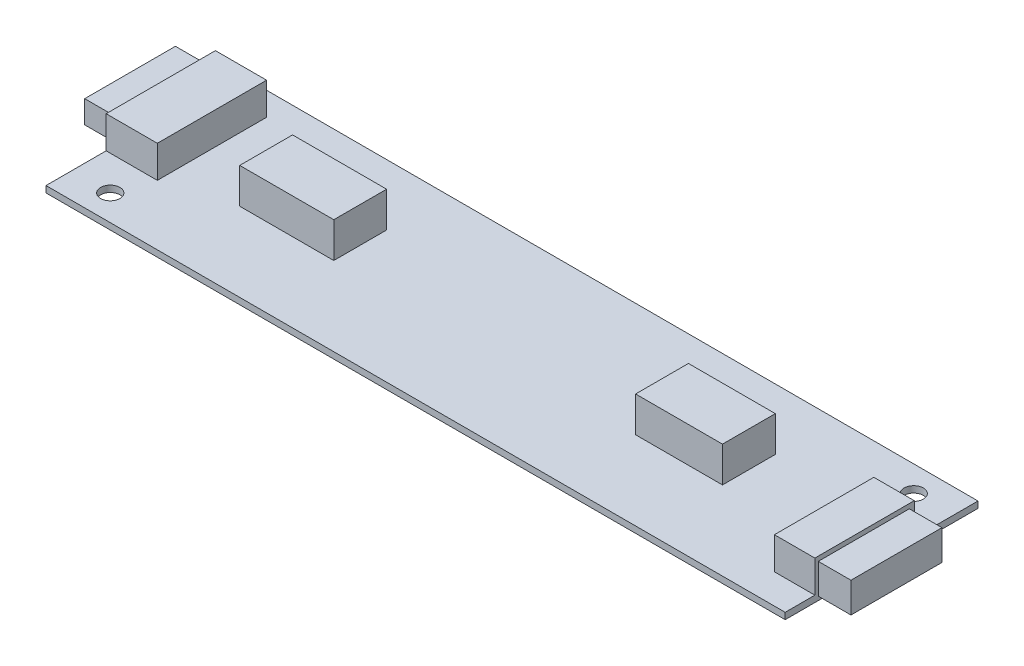
ISO-10303-21;
HEADER;
FILE_DESCRIPTION(('STEP AP214'),'2;1');
FILE_NAME('part.step','',(''),(''),'','','');
FILE_SCHEMA(('AUTOMOTIVE_DESIGN { 1 0 10303 214 1 1 1 1 }'));
ENDSEC;
DATA;
#1=APPLICATION_CONTEXT('core data for automotive mechanical design processes');
#2=APPLICATION_PROTOCOL_DEFINITION('international standard','automotive_design',2000,#1);
#3=PRODUCT_CONTEXT('',#1,'mechanical');
#4=PRODUCT('Part','Part','',(#3));
#5=PRODUCT_RELATED_PRODUCT_CATEGORY('part','',(#4));
#6=PRODUCT_DEFINITION_FORMATION('','',#4);
#7=PRODUCT_DEFINITION_CONTEXT('part definition',#1,'design');
#8=PRODUCT_DEFINITION('design','',#6,#7);
#9=PRODUCT_DEFINITION_SHAPE('','',#8);
#10=(LENGTH_UNIT() NAMED_UNIT(*) SI_UNIT(.MILLI.,.METRE.));
#11=(NAMED_UNIT(*) PLANE_ANGLE_UNIT() SI_UNIT($,.RADIAN.));
#12=(NAMED_UNIT(*) SI_UNIT($,.STERADIAN.) SOLID_ANGLE_UNIT());
#13=UNCERTAINTY_MEASURE_WITH_UNIT(LENGTH_MEASURE(1.E-05),#10,'distance_accuracy_value','');
#14=(GEOMETRIC_REPRESENTATION_CONTEXT(3) GLOBAL_UNCERTAINTY_ASSIGNED_CONTEXT((#13)) GLOBAL_UNIT_ASSIGNED_CONTEXT((#10,
#11,#12)) REPRESENTATION_CONTEXT('',''));
#15=CARTESIAN_POINT('',(0.,0.,0.));
#16=DIRECTION('',(0.,0.,1.));
#17=DIRECTION('',(1.,0.,0.));
#18=AXIS2_PLACEMENT_3D('',#15,#16,#17);
#19=CARTESIAN_POINT('',(0.,1.,0.));
#20=DIRECTION('',(1.,0.,0.));
#21=DIRECTION('',(0.,0.,-1.));
#22=AXIS2_PLACEMENT_3D('',#19,#20,#21);
#23=PLANE('',#22);
#24=DIRECTION('',(0.,0.,1.));
#25=VECTOR('',#24,1.);
#26=CARTESIAN_POINT('',(0.,0.,0.));
#27=LINE('',#26,#25);
#28=CARTESIAN_POINT('',(0.,0.,0.));
#29=VERTEX_POINT('',#28);
#30=CARTESIAN_POINT('',(0.,0.,30.));
#31=VERTEX_POINT('',#30);
#32=EDGE_CURVE('E408',#29,#31,#27,.T.);
#33=ORIENTED_EDGE('',*,*,#32,.T.);
#34=DIRECTION('',(0.,-1.,0.));
#35=VECTOR('',#34,1.);
#36=CARTESIAN_POINT('',(0.,1.,30.));
#37=LINE('',#36,#35);
#38=CARTESIAN_POINT('',(0.,1.,30.));
#39=VERTEX_POINT('',#38);
#40=EDGE_CURVE('E11',#39,#31,#37,.T.);
#41=ORIENTED_EDGE('',*,*,#40,.F.);
#42=DIRECTION('',(0.,0.,1.));
#43=VECTOR('',#42,1.);
#44=CARTESIAN_POINT('',(0.,1.,0.));
#45=LINE('',#44,#43);
#46=CARTESIAN_POINT('',(0.,1.,20.6434023991276));
#47=VERTEX_POINT('',#46);
#48=EDGE_CURVE('E417',#47,#39,#45,.T.);
#49=ORIENTED_EDGE('',*,*,#48,.F.);
#50=DIRECTION('',(0.,-1.,0.));
#51=VECTOR('',#50,1.);
#52=CARTESIAN_POINT('',(0.,6.00000000000001,20.6434023991276));
#53=LINE('',#52,#51);
#54=CARTESIAN_POINT('',(0.,6.00000000000001,20.6434023991276));
#55=VERTEX_POINT('',#54);
#56=EDGE_CURVE('E299',#55,#47,#53,.T.);
#57=ORIENTED_EDGE('',*,*,#56,.F.);
#58=DIRECTION('',(0.,0.,1.));
#59=VECTOR('',#58,1.);
#60=CARTESIAN_POINT('',(0.,6.00000000000001,3.64352356718768));
#61=LINE('',#60,#59);
#62=CARTESIAN_POINT('',(0.,6.00000000000001,3.64352356718768));
#63=VERTEX_POINT('',#62);
#64=EDGE_CURVE('E292',#63,#55,#61,.T.);
#65=ORIENTED_EDGE('',*,*,#64,.F.);
#66=DIRECTION('',(0.,-1.,0.));
#67=VECTOR('',#66,1.);
#68=CARTESIAN_POINT('',(0.,6.00000000000001,3.64352356718768));
#69=LINE('',#68,#67);
#70=CARTESIAN_POINT('',(0.,1.,3.64352356718768));
#71=VERTEX_POINT('',#70);
#72=EDGE_CURVE('E302',#63,#71,#69,.T.);
#73=ORIENTED_EDGE('',*,*,#72,.T.);
#74=CARTESIAN_POINT('',(0.,1.,0.));
#75=VERTEX_POINT('',#74);
#76=EDGE_CURVE('E418',#75,#71,#45,.T.);
#77=ORIENTED_EDGE('',*,*,#76,.F.);
#78=DIRECTION('',(0.,-1.,0.));
#79=VECTOR('',#78,1.);
#80=CARTESIAN_POINT('',(0.,1.,0.));
#81=LINE('',#80,#79);
#82=EDGE_CURVE('E427',#75,#29,#81,.T.);
#83=ORIENTED_EDGE('',*,*,#82,.T.);
#84=EDGE_LOOP('',(#33,#41,#49,#57,#65,#73,#77,#83));
#85=FACE_BOUND('',#84,.T.);
#86=DIRECTION('',(0.,-1.,0.));
#87=VECTOR('',#86,1.);
#88=CARTESIAN_POINT('',(0.,4.61560479705092,4.78308665408633));
#89=LINE('',#88,#87);
#90=CARTESIAN_POINT('',(0.,4.61560479705092,4.78308665408633));
#91=VERTEX_POINT('',#90);
#92=CARTESIAN_POINT('',(0.,1.0835301693124,4.78308665408633));
#93=VERTEX_POINT('',#92);
#94=EDGE_CURVE('E213',#91,#93,#89,.T.);
#95=ORIENTED_EDGE('',*,*,#94,.F.);
#96=DIRECTION('',(0.,0.,-1.));
#97=VECTOR('',#96,1.);
#98=CARTESIAN_POINT('',(0.,4.61560479705092,4.78308665408633));
#99=LINE('',#98,#97);
#100=CARTESIAN_POINT('',(0.,4.61560479705092,18.9002052066645));
#101=VERTEX_POINT('',#100);
#102=EDGE_CURVE('E215',#101,#91,#99,.T.);
#103=ORIENTED_EDGE('',*,*,#102,.F.);
#104=DIRECTION('',(0.,1.,0.));
#105=VECTOR('',#104,1.);
#106=CARTESIAN_POINT('',(0.,4.61560479705092,18.9002052066645));
#107=LINE('',#106,#105);
#108=CARTESIAN_POINT('',(0.,1.0835301693124,18.9002052066645));
#109=VERTEX_POINT('',#108);
#110=EDGE_CURVE('E52',#109,#101,#107,.T.);
#111=ORIENTED_EDGE('',*,*,#110,.F.);
#112=DIRECTION('',(0.,0.,1.));
#113=VECTOR('',#112,1.);
#114=CARTESIAN_POINT('',(0.,1.0835301693124,4.78308665408633));
#115=LINE('',#114,#113);
#116=EDGE_CURVE('E47',#93,#109,#115,.T.);
#117=ORIENTED_EDGE('',*,*,#116,.F.);
#118=EDGE_LOOP('',(#95,#103,#111,#117));
#119=FACE_BOUND('',#118,.T.);
#120=ADVANCED_FACE('F33',(#85,#119),#23,.F.);
#121=CARTESIAN_POINT('',(115.,0.99999999999989,0.));
#122=DIRECTION('',(-1.,0.,0.));
#123=DIRECTION('',(0.,0.,1.));
#124=AXIS2_PLACEMENT_3D('',#121,#122,#123);
#125=PLANE('',#124);
#126=DIRECTION('',(0.,0.,-1.));
#127=VECTOR('',#126,1.);
#128=CARTESIAN_POINT('',(115.,-1.11022302462516E-13,0.));
#129=LINE('',#128,#127);
#130=CARTESIAN_POINT('',(115.,-1.11022302462516E-13,30.));
#131=VERTEX_POINT('',#130);
#132=CARTESIAN_POINT('',(115.,-1.11022302462516E-13,0.));
#133=VERTEX_POINT('',#132);
#134=EDGE_CURVE('E413',#131,#133,#129,.T.);
#135=ORIENTED_EDGE('',*,*,#134,.T.);
#136=DIRECTION('',(0.,-1.,0.));
#137=VECTOR('',#136,1.);
#138=CARTESIAN_POINT('',(115.,0.99999999999989,0.));
#139=LINE('',#138,#137);
#140=CARTESIAN_POINT('',(115.,0.99999999999989,0.));
#141=VERTEX_POINT('',#140);
#142=EDGE_CURVE('E430',#141,#133,#139,.T.);
#143=ORIENTED_EDGE('',*,*,#142,.F.);
#144=DIRECTION('',(0.,0.,-1.));
#145=VECTOR('',#144,1.);
#146=CARTESIAN_POINT('',(115.,0.99999999999989,0.));
#147=LINE('',#146,#145);
#148=CARTESIAN_POINT('',(115.,0.99999999999989,9.91397067732945));
#149=VERTEX_POINT('',#148);
#150=EDGE_CURVE('E422',#149,#141,#147,.T.);
#151=ORIENTED_EDGE('',*,*,#150,.F.);
#152=DIRECTION('',(0.,-1.,0.));
#153=VECTOR('',#152,1.);
#154=CARTESIAN_POINT('',(115.,5.99999999999998,9.91397067732945));
#155=LINE('',#154,#153);
#156=CARTESIAN_POINT('',(115.,5.99999999999998,9.91397067732945));
#157=VERTEX_POINT('',#156);
#158=EDGE_CURVE('E335',#157,#149,#155,.T.);
#159=ORIENTED_EDGE('',*,*,#158,.F.);
#160=DIRECTION('',(0.,0.,-1.));
#161=VECTOR('',#160,1.);
#162=CARTESIAN_POINT('',(115.,5.99999999999998,9.91397067732945));
#163=LINE('',#162,#161);
#164=CARTESIAN_POINT('',(115.,5.99999999999998,25.3810735490125));
#165=VERTEX_POINT('',#164);
#166=EDGE_CURVE('E317',#165,#157,#163,.T.);
#167=ORIENTED_EDGE('',*,*,#166,.F.);
#168=DIRECTION('',(0.,-1.,0.));
#169=VECTOR('',#168,1.);
#170=CARTESIAN_POINT('',(115.,5.99999999999998,25.3810735490125));
#171=LINE('',#170,#169);
#172=CARTESIAN_POINT('',(115.,0.99999999999989,25.3810735490125));
#173=VERTEX_POINT('',#172);
#174=EDGE_CURVE('E326',#165,#173,#171,.T.);
#175=ORIENTED_EDGE('',*,*,#174,.T.);
#176=CARTESIAN_POINT('',(115.,0.99999999999989,30.));
#177=VERTEX_POINT('',#176);
#178=EDGE_CURVE('E423',#177,#173,#147,.T.);
#179=ORIENTED_EDGE('',*,*,#178,.F.);
#180=DIRECTION('',(0.,-1.,0.));
#181=VECTOR('',#180,1.);
#182=CARTESIAN_POINT('',(115.,0.99999999999989,30.));
#183=LINE('',#182,#181);
#184=EDGE_CURVE('E40',#177,#131,#183,.T.);
#185=ORIENTED_EDGE('',*,*,#184,.T.);
#186=EDGE_LOOP('',(#135,#143,#151,#159,#167,#175,#179,#185));
#187=FACE_BOUND('',#186,.T.);
#188=DIRECTION('',(0.,-1.,0.));
#189=VECTOR('',#188,1.);
#190=CARTESIAN_POINT('',(115.,5.2864495555339,24.8451802650276));
#191=LINE('',#190,#189);
#192=CARTESIAN_POINT('',(115.,5.2864495555339,24.8451802650276));
#193=VERTEX_POINT('',#192);
#194=CARTESIAN_POINT('',(115.,0.595593337960054,24.8451802650276));
#195=VERTEX_POINT('',#194);
#196=EDGE_CURVE('E245',#193,#195,#191,.T.);
#197=ORIENTED_EDGE('',*,*,#196,.F.);
#198=DIRECTION('',(0.,0.,1.));
#199=VECTOR('',#198,1.);
#200=CARTESIAN_POINT('',(115.,5.2864495555339,24.8451802650276));
#201=LINE('',#200,#199);
#202=CARTESIAN_POINT('',(115.,5.2864495555339,10.6883447341463));
#203=VERTEX_POINT('',#202);
#204=EDGE_CURVE('E254',#203,#193,#201,.T.);
#205=ORIENTED_EDGE('',*,*,#204,.F.);
#206=DIRECTION('',(0.,1.,0.));
#207=VECTOR('',#206,1.);
#208=CARTESIAN_POINT('',(115.,5.2864495555339,10.6883447341463));
#209=LINE('',#208,#207);
#210=CARTESIAN_POINT('',(115.,0.595593337960054,10.6883447341463));
#211=VERTEX_POINT('',#210);
#212=EDGE_CURVE('E251',#211,#203,#209,.T.);
#213=ORIENTED_EDGE('',*,*,#212,.F.);
#214=DIRECTION('',(0.,0.,-1.));
#215=VECTOR('',#214,1.);
#216=CARTESIAN_POINT('',(115.,0.595593337960054,24.8451802650276));
#217=LINE('',#216,#215);
#218=EDGE_CURVE('E248',#195,#211,#217,.T.);
#219=ORIENTED_EDGE('',*,*,#218,.F.);
#220=EDGE_LOOP('',(#197,#205,#213,#219));
#221=FACE_BOUND('',#220,.T.);
#222=ADVANCED_FACE('F437',(#187,#221),#125,.F.);
#223=CARTESIAN_POINT('',(0.,1.,30.));
#224=DIRECTION('',(0.,1.,0.));
#225=DIRECTION('',(0.,0.,1.));
#226=AXIS2_PLACEMENT_3D('',#223,#224,#225);
#227=PLANE('',#226);
#228=DIRECTION('',(-1.,0.,0.));
#229=VECTOR('',#228,1.);
#230=CARTESIAN_POINT('',(92.9628619895796,1.,9.49594086998667));
#231=LINE('',#230,#229);
#232=CARTESIAN_POINT('',(92.9628619895796,1.,9.49594086998667));
#233=VERTEX_POINT('',#232);
#234=CARTESIAN_POINT('',(79.4465648854962,1.,9.49594086998667));
#235=VERTEX_POINT('',#234);
#236=EDGE_CURVE('E370',#233,#235,#231,.T.);
#237=ORIENTED_EDGE('',*,*,#236,.F.);
#238=DIRECTION('',(0.,0.,-1.));
#239=VECTOR('',#238,1.);
#240=CARTESIAN_POINT('',(92.9628619895796,1.,9.49594086998667));
#241=LINE('',#240,#239);
#242=CARTESIAN_POINT('',(92.9628619895796,1.,17.7171937477281));
#243=VERTEX_POINT('',#242);
#244=EDGE_CURVE('E367',#243,#233,#241,.T.);
#245=ORIENTED_EDGE('',*,*,#244,.F.);
#246=DIRECTION('',(1.,0.,0.));
#247=VECTOR('',#246,1.);
#248=CARTESIAN_POINT('',(92.9628619895796,1.,17.7171937477281));
#249=LINE('',#248,#247);
#250=CARTESIAN_POINT('',(79.4465648854962,1.,17.7171937477281));
#251=VERTEX_POINT('',#250);
#252=EDGE_CURVE('E375',#251,#243,#249,.T.);
#253=ORIENTED_EDGE('',*,*,#252,.F.);
#254=DIRECTION('',(0.,0.,1.));
#255=VECTOR('',#254,1.);
#256=CARTESIAN_POINT('',(79.4465648854962,1.,9.49594086998667));
#257=LINE('',#256,#255);
#258=EDGE_CURVE('E372',#235,#251,#257,.T.);
#259=ORIENTED_EDGE('',*,*,#258,.F.);
#260=EDGE_LOOP('',(#237,#245,#253,#259));
#261=FACE_BOUND('',#260,.T.);
#262=CARTESIAN_POINT('',(6.,1.,26.));
#263=DIRECTION('',(0.,1.,0.));
#264=DIRECTION('',(0.,0.,1.));
#265=AXIS2_PLACEMENT_3D('',#262,#263,#264);
#266=CIRCLE('',#265,1.5);
#267=CARTESIAN_POINT('',(6.,1.,27.5));
#268=VERTEX_POINT('',#267);
#269=EDGE_CURVE('E396',#268,#268,#266,.T.);
#270=ORIENTED_EDGE('',*,*,#269,.F.);
#271=EDGE_LOOP('',(#270));
#272=FACE_BOUND('',#271,.T.);
#273=CARTESIAN_POINT('',(109.,0.999999999999973,4.));
#274=DIRECTION('',(0.,1.,0.));
#275=DIRECTION('',(0.,0.,1.));
#276=AXIS2_PLACEMENT_3D('',#273,#274,#275);
#277=CIRCLE('',#276,1.5);
#278=CARTESIAN_POINT('',(109.,0.999999999999973,5.5));
#279=VERTEX_POINT('',#278);
#280=EDGE_CURVE('E402',#279,#279,#277,.T.);
#281=ORIENTED_EDGE('',*,*,#280,.F.);
#282=EDGE_LOOP('',(#281));
#283=FACE_BOUND('',#282,.T.);
#284=DIRECTION('',(-1.,0.,0.));
#285=VECTOR('',#284,1.);
#286=CARTESIAN_POINT('',(32.4878831939901,1.,9.49594086998667));
#287=LINE('',#286,#285);
#288=CARTESIAN_POINT('',(32.4878831939901,1.,9.49594086998667));
#289=VERTEX_POINT('',#288);
#290=CARTESIAN_POINT('',(17.8568399369926,1.,9.49594086998667));
#291=VERTEX_POINT('',#290);
#292=EDGE_CURVE('E341',#289,#291,#287,.T.);
#293=ORIENTED_EDGE('',*,*,#292,.F.);
#294=DIRECTION('',(0.,0.,-1.));
#295=VECTOR('',#294,1.);
#296=CARTESIAN_POINT('',(32.4878831939901,1.,9.49594086998667));
#297=LINE('',#296,#295);
#298=CARTESIAN_POINT('',(32.4878831939901,1.,17.7171937477281));
#299=VERTEX_POINT('',#298);
#300=EDGE_CURVE('E338',#299,#289,#297,.T.);
#301=ORIENTED_EDGE('',*,*,#300,.F.);
#302=DIRECTION('',(1.,0.,0.));
#303=VECTOR('',#302,1.);
#304=CARTESIAN_POINT('',(32.4878831939901,1.,17.7171937477281));
#305=LINE('',#304,#303);
#306=CARTESIAN_POINT('',(17.8568399369926,1.,17.7171937477281));
#307=VERTEX_POINT('',#306);
#308=EDGE_CURVE('E346',#307,#299,#305,.T.);
#309=ORIENTED_EDGE('',*,*,#308,.F.);
#310=DIRECTION('',(0.,0.,1.));
#311=VECTOR('',#310,1.);
#312=CARTESIAN_POINT('',(17.8568399369926,1.,9.49594086998667));
#313=LINE('',#312,#311);
#314=EDGE_CURVE('E343',#291,#307,#313,.T.);
#315=ORIENTED_EDGE('',*,*,#314,.F.);
#316=EDGE_LOOP('',(#293,#301,#309,#315));
#317=FACE_BOUND('',#316,.T.);
#318=ORIENTED_EDGE('',*,*,#76,.T.);
#319=DIRECTION('',(-1.,0.,0.));
#320=VECTOR('',#319,1.);
#321=CARTESIAN_POINT('',(7.96346782988006,1.,3.64352356718768));
#322=LINE('',#321,#320);
#323=CARTESIAN_POINT('',(7.96346782988006,1.,3.64352356718768));
#324=VERTEX_POINT('',#323);
#325=EDGE_CURVE('E281',#324,#71,#322,.T.);
#326=ORIENTED_EDGE('',*,*,#325,.F.);
#327=DIRECTION('',(0.,0.,-1.));
#328=VECTOR('',#327,1.);
#329=CARTESIAN_POINT('',(7.96346782988006,1.,3.64352356718768));
#330=LINE('',#329,#328);
#331=CARTESIAN_POINT('',(7.96346782988006,1.,20.6434023991276));
#332=VERTEX_POINT('',#331);
#333=EDGE_CURVE('E278',#332,#324,#330,.T.);
#334=ORIENTED_EDGE('',*,*,#333,.F.);
#335=DIRECTION('',(1.,0.,0.));
#336=VECTOR('',#335,1.);
#337=CARTESIAN_POINT('',(7.96346782988006,1.,20.6434023991276));
#338=LINE('',#337,#336);
#339=EDGE_CURVE('E284',#47,#332,#338,.T.);
#340=ORIENTED_EDGE('',*,*,#339,.F.);
#341=ORIENTED_EDGE('',*,*,#48,.T.);
#342=DIRECTION('',(1.,0.,0.));
#343=VECTOR('',#342,1.);
#344=CARTESIAN_POINT('',(0.,1.,30.));
#345=LINE('',#344,#343);
#346=EDGE_CURVE('E420',#39,#177,#345,.T.);
#347=ORIENTED_EDGE('',*,*,#346,.T.);
#348=ORIENTED_EDGE('',*,*,#178,.T.);
#349=DIRECTION('',(1.,0.,0.));
#350=VECTOR('',#349,1.);
#351=CARTESIAN_POINT('',(115.,0.99999999999989,25.3810735490125));
#352=LINE('',#351,#350);
#353=CARTESIAN_POINT('',(108.708651399491,0.999999999999973,25.3810735490125));
#354=VERTEX_POINT('',#353);
#355=EDGE_CURVE('E314',#354,#173,#352,.T.);
#356=ORIENTED_EDGE('',*,*,#355,.F.);
#357=DIRECTION('',(0.,0.,1.));
#358=VECTOR('',#357,1.);
#359=CARTESIAN_POINT('',(108.708651399491,0.999999999999973,9.91397067732945));
#360=LINE('',#359,#358);
#361=CARTESIAN_POINT('',(108.708651399491,0.999999999999973,9.91397067732945));
#362=VERTEX_POINT('',#361);
#363=EDGE_CURVE('E311',#362,#354,#360,.T.);
#364=ORIENTED_EDGE('',*,*,#363,.F.);
#365=DIRECTION('',(-1.,0.,0.));
#366=VECTOR('',#365,1.);
#367=CARTESIAN_POINT('',(115.,0.99999999999989,9.91397067732945));
#368=LINE('',#367,#366);
#369=EDGE_CURVE('E308',#149,#362,#368,.T.);
#370=ORIENTED_EDGE('',*,*,#369,.F.);
#371=ORIENTED_EDGE('',*,*,#150,.T.);
#372=DIRECTION('',(-1.,0.,0.));
#373=VECTOR('',#372,1.);
#374=CARTESIAN_POINT('',(0.,1.,0.));
#375=LINE('',#374,#373);
#376=EDGE_CURVE('E425',#141,#75,#375,.T.);
#377=ORIENTED_EDGE('',*,*,#376,.T.);
#378=EDGE_LOOP('',(#318,#326,#334,#340,#341,#347,#348,#356,#364,#370,#371,#377));
#379=FACE_BOUND('',#378,.T.);
#380=ADVANCED_FACE('F456',(#261,#272,#283,#317,#379),#227,.T.);
#381=CARTESIAN_POINT('',(0.,1.,30.));
#382=DIRECTION('',(0.,0.,-1.));
#383=DIRECTION('',(-1.,0.,0.));
#384=AXIS2_PLACEMENT_3D('',#381,#382,#383);
#385=PLANE('',#384);
#386=DIRECTION('',(1.,0.,0.));
#387=VECTOR('',#386,1.);
#388=CARTESIAN_POINT('',(0.,0.,30.));
#389=LINE('',#388,#387);
#390=EDGE_CURVE('E411',#31,#131,#389,.T.);
#391=ORIENTED_EDGE('',*,*,#390,.T.);
#392=ORIENTED_EDGE('',*,*,#184,.F.);
#393=ORIENTED_EDGE('',*,*,#346,.F.);
#394=ORIENTED_EDGE('',*,*,#40,.T.);
#395=EDGE_LOOP('',(#391,#392,#393,#394));
#396=FACE_BOUND('',#395,.T.);
#397=ADVANCED_FACE('F469',(#396),#385,.F.);
#398=CARTESIAN_POINT('',(0.,1.,0.));
#399=DIRECTION('',(0.,0.,1.));
#400=DIRECTION('',(1.,0.,0.));
#401=AXIS2_PLACEMENT_3D('',#398,#399,#400);
#402=PLANE('',#401);
#403=DIRECTION('',(-1.,0.,0.));
#404=VECTOR('',#403,1.);
#405=CARTESIAN_POINT('',(0.,0.,0.));
#406=LINE('',#405,#404);
#407=EDGE_CURVE('E415',#133,#29,#406,.T.);
#408=ORIENTED_EDGE('',*,*,#407,.T.);
#409=ORIENTED_EDGE('',*,*,#82,.F.);
#410=ORIENTED_EDGE('',*,*,#376,.F.);
#411=ORIENTED_EDGE('',*,*,#142,.T.);
#412=EDGE_LOOP('',(#408,#409,#410,#411));
#413=FACE_BOUND('',#412,.T.);
#414=ADVANCED_FACE('F448',(#413),#402,.F.);
#415=CARTESIAN_POINT('',(0.,0.,30.));
#416=DIRECTION('',(0.,1.,0.));
#417=DIRECTION('',(0.,0.,1.));
#418=AXIS2_PLACEMENT_3D('',#415,#416,#417);
#419=PLANE('',#418);
#420=CARTESIAN_POINT('',(6.,0.,26.));
#421=DIRECTION('',(0.,1.,0.));
#422=DIRECTION('',(0.,0.,1.));
#423=AXIS2_PLACEMENT_3D('',#420,#421,#422);
#424=CIRCLE('',#423,1.5);
#425=CARTESIAN_POINT('',(6.,0.,27.5));
#426=VERTEX_POINT('',#425);
#427=EDGE_CURVE('E399',#426,#426,#424,.T.);
#428=ORIENTED_EDGE('',*,*,#427,.T.);
#429=EDGE_LOOP('',(#428));
#430=FACE_BOUND('',#429,.T.);
#431=CARTESIAN_POINT('',(109.,0.,4.));
#432=DIRECTION('',(0.,1.,0.));
#433=DIRECTION('',(0.,0.,1.));
#434=AXIS2_PLACEMENT_3D('',#431,#432,#433);
#435=CIRCLE('',#434,1.5);
#436=CARTESIAN_POINT('',(109.,0.,5.5));
#437=VERTEX_POINT('',#436);
#438=EDGE_CURVE('E405',#437,#437,#435,.T.);
#439=ORIENTED_EDGE('',*,*,#438,.T.);
#440=EDGE_LOOP('',(#439));
#441=FACE_BOUND('',#440,.T.);
#442=ORIENTED_EDGE('',*,*,#32,.F.);
#443=ORIENTED_EDGE('',*,*,#407,.F.);
#444=ORIENTED_EDGE('',*,*,#134,.F.);
#445=ORIENTED_EDGE('',*,*,#390,.F.);
#446=EDGE_LOOP('',(#442,#443,#444,#445));
#447=FACE_BOUND('',#446,.T.);
#448=ADVANCED_FACE('F445',(#430,#441,#447),#419,.F.);
#449=CARTESIAN_POINT('',(109.,0.,4.));
#450=DIRECTION('',(0.,1.,0.));
#451=DIRECTION('',(0.,0.,1.));
#452=AXIS2_PLACEMENT_3D('',#449,#450,#451);
#453=CYLINDRICAL_SURFACE('',#452,1.5);
#454=ORIENTED_EDGE('',*,*,#438,.F.);
#455=EDGE_LOOP('',(#454));
#456=FACE_BOUND('',#455,.T.);
#457=ORIENTED_EDGE('',*,*,#280,.T.);
#458=EDGE_LOOP('',(#457));
#459=FACE_BOUND('',#458,.T.);
#460=ADVANCED_FACE('F488',(#456,#459),#453,.F.);
#461=CARTESIAN_POINT('',(6.,0.,26.));
#462=DIRECTION('',(0.,1.,0.));
#463=DIRECTION('',(0.,0.,1.));
#464=AXIS2_PLACEMENT_3D('',#461,#462,#463);
#465=CYLINDRICAL_SURFACE('',#464,1.5);
#466=ORIENTED_EDGE('',*,*,#427,.F.);
#467=EDGE_LOOP('',(#466));
#468=FACE_BOUND('',#467,.T.);
#469=ORIENTED_EDGE('',*,*,#269,.T.);
#470=EDGE_LOOP('',(#469));
#471=FACE_BOUND('',#470,.T.);
#472=ADVANCED_FACE('F492',(#468,#471),#465,.F.);
#473=CARTESIAN_POINT('',(92.9628619895796,6.49999999999998,9.49594086998667));
#474=DIRECTION('',(-1.,0.,0.));
#475=DIRECTION('',(0.,0.,1.));
#476=AXIS2_PLACEMENT_3D('',#473,#474,#475);
#477=PLANE('',#476);
#478=ORIENTED_EDGE('',*,*,#244,.T.);
#479=DIRECTION('',(0.,-1.,0.));
#480=VECTOR('',#479,1.);
#481=CARTESIAN_POINT('',(92.9628619895796,6.49999999999998,9.49594086998667));
#482=LINE('',#481,#480);
#483=CARTESIAN_POINT('',(92.9628619895796,6.49999999999998,9.49594086998667));
#484=VERTEX_POINT('',#483);
#485=EDGE_CURVE('E394',#484,#233,#482,.T.);
#486=ORIENTED_EDGE('',*,*,#485,.F.);
#487=DIRECTION('',(0.,0.,-1.));
#488=VECTOR('',#487,1.);
#489=CARTESIAN_POINT('',(92.9628619895796,6.49999999999998,9.49594086998667));
#490=LINE('',#489,#488);
#491=CARTESIAN_POINT('',(92.9628619895796,6.49999999999998,17.7171937477281));
#492=VERTEX_POINT('',#491);
#493=EDGE_CURVE('E377',#492,#484,#490,.T.);
#494=ORIENTED_EDGE('',*,*,#493,.F.);
#495=DIRECTION('',(0.,-1.,0.));
#496=VECTOR('',#495,1.);
#497=CARTESIAN_POINT('',(92.9628619895796,6.49999999999998,17.7171937477281));
#498=LINE('',#497,#496);
#499=EDGE_CURVE('E386',#492,#243,#498,.T.);
#500=ORIENTED_EDGE('',*,*,#499,.T.);
#501=EDGE_LOOP('',(#478,#486,#494,#500));
#502=FACE_BOUND('',#501,.T.);
#503=ADVANCED_FACE('F496',(#502),#477,.F.);
#504=CARTESIAN_POINT('',(92.9628619895796,6.49999999999998,9.49594086998667));
#505=DIRECTION('',(0.,0.,1.));
#506=DIRECTION('',(1.,0.,0.));
#507=AXIS2_PLACEMENT_3D('',#504,#505,#506);
#508=PLANE('',#507);
#509=ORIENTED_EDGE('',*,*,#236,.T.);
#510=DIRECTION('',(0.,-1.,0.));
#511=VECTOR('',#510,1.);
#512=CARTESIAN_POINT('',(79.4465648854962,6.49999999999998,9.49594086998667));
#513=LINE('',#512,#511);
#514=CARTESIAN_POINT('',(79.4465648854962,6.49999999999998,9.49594086998667));
#515=VERTEX_POINT('',#514);
#516=EDGE_CURVE('E391',#515,#235,#513,.T.);
#517=ORIENTED_EDGE('',*,*,#516,.F.);
#518=DIRECTION('',(-1.,0.,0.));
#519=VECTOR('',#518,1.);
#520=CARTESIAN_POINT('',(92.9628619895796,6.49999999999998,9.49594086998667));
#521=LINE('',#520,#519);
#522=EDGE_CURVE('E380',#484,#515,#521,.T.);
#523=ORIENTED_EDGE('',*,*,#522,.F.);
#524=ORIENTED_EDGE('',*,*,#485,.T.);
#525=EDGE_LOOP('',(#509,#517,#523,#524));
#526=FACE_BOUND('',#525,.T.);
#527=ADVANCED_FACE('F500',(#526),#508,.F.);
#528=CARTESIAN_POINT('',(79.4465648854962,6.49999999999998,9.49594086998667));
#529=DIRECTION('',(1.,0.,0.));
#530=DIRECTION('',(0.,0.,-1.));
#531=AXIS2_PLACEMENT_3D('',#528,#529,#530);
#532=PLANE('',#531);
#533=ORIENTED_EDGE('',*,*,#258,.T.);
#534=DIRECTION('',(0.,-1.,0.));
#535=VECTOR('',#534,1.);
#536=CARTESIAN_POINT('',(79.4465648854962,6.49999999999998,17.7171937477281));
#537=LINE('',#536,#535);
#538=CARTESIAN_POINT('',(79.4465648854962,6.49999999999998,17.7171937477281));
#539=VERTEX_POINT('',#538);
#540=EDGE_CURVE('E389',#539,#251,#537,.T.);
#541=ORIENTED_EDGE('',*,*,#540,.F.);
#542=DIRECTION('',(0.,0.,1.));
#543=VECTOR('',#542,1.);
#544=CARTESIAN_POINT('',(79.4465648854962,6.49999999999998,9.49594086998667));
#545=LINE('',#544,#543);
#546=EDGE_CURVE('E382',#515,#539,#545,.T.);
#547=ORIENTED_EDGE('',*,*,#546,.F.);
#548=ORIENTED_EDGE('',*,*,#516,.T.);
#549=EDGE_LOOP('',(#533,#541,#547,#548));
#550=FACE_BOUND('',#549,.T.);
#551=ADVANCED_FACE('F504',(#550),#532,.F.);
#552=CARTESIAN_POINT('',(92.9628619895796,6.49999999999998,17.7171937477281));
#553=DIRECTION('',(0.,0.,-1.));
#554=DIRECTION('',(-1.,0.,0.));
#555=AXIS2_PLACEMENT_3D('',#552,#553,#554);
#556=PLANE('',#555);
#557=ORIENTED_EDGE('',*,*,#252,.T.);
#558=ORIENTED_EDGE('',*,*,#499,.F.);
#559=DIRECTION('',(1.,0.,0.));
#560=VECTOR('',#559,1.);
#561=CARTESIAN_POINT('',(92.9628619895796,6.49999999999998,17.7171937477281));
#562=LINE('',#561,#560);
#563=EDGE_CURVE('E384',#539,#492,#562,.T.);
#564=ORIENTED_EDGE('',*,*,#563,.F.);
#565=ORIENTED_EDGE('',*,*,#540,.T.);
#566=EDGE_LOOP('',(#557,#558,#564,#565));
#567=FACE_BOUND('',#566,.T.);
#568=ADVANCED_FACE('F508',(#567),#556,.F.);
#569=CARTESIAN_POINT('',(92.9628619895796,6.49999999999998,17.7171937477281));
#570=DIRECTION('',(0.,-1.,0.));
#571=DIRECTION('',(0.,0.,-1.));
#572=AXIS2_PLACEMENT_3D('',#569,#570,#571);
#573=PLANE('',#572);
#574=ORIENTED_EDGE('',*,*,#493,.T.);
#575=ORIENTED_EDGE('',*,*,#522,.T.);
#576=ORIENTED_EDGE('',*,*,#546,.T.);
#577=ORIENTED_EDGE('',*,*,#563,.T.);
#578=EDGE_LOOP('',(#574,#575,#576,#577));
#579=FACE_BOUND('',#578,.T.);
#580=ADVANCED_FACE('F512',(#579),#573,.F.);
#581=CARTESIAN_POINT('',(32.4878831939901,6.50000000000001,9.49594086998667));
#582=DIRECTION('',(-1.,0.,0.));
#583=DIRECTION('',(0.,0.,1.));
#584=AXIS2_PLACEMENT_3D('',#581,#582,#583);
#585=PLANE('',#584);
#586=ORIENTED_EDGE('',*,*,#300,.T.);
#587=DIRECTION('',(0.,-1.,0.));
#588=VECTOR('',#587,1.);
#589=CARTESIAN_POINT('',(32.4878831939901,6.50000000000001,9.49594086998667));
#590=LINE('',#589,#588);
#591=CARTESIAN_POINT('',(32.4878831939901,6.50000000000001,9.49594086998667));
#592=VERTEX_POINT('',#591);
#593=EDGE_CURVE('E365',#592,#289,#590,.T.);
#594=ORIENTED_EDGE('',*,*,#593,.F.);
#595=DIRECTION('',(0.,0.,-1.));
#596=VECTOR('',#595,1.);
#597=CARTESIAN_POINT('',(32.4878831939901,6.50000000000001,9.49594086998667));
#598=LINE('',#597,#596);
#599=CARTESIAN_POINT('',(32.4878831939901,6.50000000000001,17.7171937477281));
#600=VERTEX_POINT('',#599);
#601=EDGE_CURVE('E348',#600,#592,#598,.T.);
#602=ORIENTED_EDGE('',*,*,#601,.F.);
#603=DIRECTION('',(0.,-1.,0.));
#604=VECTOR('',#603,1.);
#605=CARTESIAN_POINT('',(32.4878831939901,6.50000000000001,17.7171937477281));
#606=LINE('',#605,#604);
#607=EDGE_CURVE('E357',#600,#299,#606,.T.);
#608=ORIENTED_EDGE('',*,*,#607,.T.);
#609=EDGE_LOOP('',(#586,#594,#602,#608));
#610=FACE_BOUND('',#609,.T.);
#611=ADVANCED_FACE('F516',(#610),#585,.F.);
#612=CARTESIAN_POINT('',(32.4878831939901,6.50000000000001,9.49594086998667));
#613=DIRECTION('',(0.,0.,1.));
#614=DIRECTION('',(1.,0.,0.));
#615=AXIS2_PLACEMENT_3D('',#612,#613,#614);
#616=PLANE('',#615);
#617=ORIENTED_EDGE('',*,*,#292,.T.);
#618=DIRECTION('',(0.,-1.,0.));
#619=VECTOR('',#618,1.);
#620=CARTESIAN_POINT('',(17.8568399369926,6.50000000000001,9.49594086998667));
#621=LINE('',#620,#619);
#622=CARTESIAN_POINT('',(17.8568399369926,6.50000000000001,9.49594086998667));
#623=VERTEX_POINT('',#622);
#624=EDGE_CURVE('E362',#623,#291,#621,.T.);
#625=ORIENTED_EDGE('',*,*,#624,.F.);
#626=DIRECTION('',(-1.,0.,0.));
#627=VECTOR('',#626,1.);
#628=CARTESIAN_POINT('',(32.4878831939901,6.50000000000001,9.49594086998667));
#629=LINE('',#628,#627);
#630=EDGE_CURVE('E351',#592,#623,#629,.T.);
#631=ORIENTED_EDGE('',*,*,#630,.F.);
#632=ORIENTED_EDGE('',*,*,#593,.T.);
#633=EDGE_LOOP('',(#617,#625,#631,#632));
#634=FACE_BOUND('',#633,.T.);
#635=ADVANCED_FACE('F520',(#634),#616,.F.);
#636=CARTESIAN_POINT('',(17.8568399369926,6.50000000000001,9.49594086998667));
#637=DIRECTION('',(1.,0.,0.));
#638=DIRECTION('',(0.,0.,-1.));
#639=AXIS2_PLACEMENT_3D('',#636,#637,#638);
#640=PLANE('',#639);
#641=ORIENTED_EDGE('',*,*,#314,.T.);
#642=DIRECTION('',(0.,-1.,0.));
#643=VECTOR('',#642,1.);
#644=CARTESIAN_POINT('',(17.8568399369926,6.50000000000001,17.7171937477281));
#645=LINE('',#644,#643);
#646=CARTESIAN_POINT('',(17.8568399369926,6.50000000000001,17.7171937477281));
#647=VERTEX_POINT('',#646);
#648=EDGE_CURVE('E360',#647,#307,#645,.T.);
#649=ORIENTED_EDGE('',*,*,#648,.F.);
#650=DIRECTION('',(0.,0.,1.));
#651=VECTOR('',#650,1.);
#652=CARTESIAN_POINT('',(17.8568399369926,6.50000000000001,9.49594086998667));
#653=LINE('',#652,#651);
#654=EDGE_CURVE('E353',#623,#647,#653,.T.);
#655=ORIENTED_EDGE('',*,*,#654,.F.);
#656=ORIENTED_EDGE('',*,*,#624,.T.);
#657=EDGE_LOOP('',(#641,#649,#655,#656));
#658=FACE_BOUND('',#657,.T.);
#659=ADVANCED_FACE('F524',(#658),#640,.F.);
#660=CARTESIAN_POINT('',(32.4878831939901,6.50000000000001,17.7171937477281));
#661=DIRECTION('',(0.,0.,-1.));
#662=DIRECTION('',(-1.,0.,0.));
#663=AXIS2_PLACEMENT_3D('',#660,#661,#662);
#664=PLANE('',#663);
#665=ORIENTED_EDGE('',*,*,#308,.T.);
#666=ORIENTED_EDGE('',*,*,#607,.F.);
#667=DIRECTION('',(1.,0.,0.));
#668=VECTOR('',#667,1.);
#669=CARTESIAN_POINT('',(32.4878831939901,6.50000000000001,17.7171937477281));
#670=LINE('',#669,#668);
#671=EDGE_CURVE('E355',#647,#600,#670,.T.);
#672=ORIENTED_EDGE('',*,*,#671,.F.);
#673=ORIENTED_EDGE('',*,*,#648,.T.);
#674=EDGE_LOOP('',(#665,#666,#672,#673));
#675=FACE_BOUND('',#674,.T.);
#676=ADVANCED_FACE('F528',(#675),#664,.F.);
#677=CARTESIAN_POINT('',(32.4878831939901,6.50000000000001,17.7171937477281));
#678=DIRECTION('',(0.,-1.,0.));
#679=DIRECTION('',(0.,0.,-1.));
#680=AXIS2_PLACEMENT_3D('',#677,#678,#679);
#681=PLANE('',#680);
#682=ORIENTED_EDGE('',*,*,#601,.T.);
#683=ORIENTED_EDGE('',*,*,#630,.T.);
#684=ORIENTED_EDGE('',*,*,#654,.T.);
#685=ORIENTED_EDGE('',*,*,#671,.T.);
#686=EDGE_LOOP('',(#682,#683,#684,#685));
#687=FACE_BOUND('',#686,.T.);
#688=ADVANCED_FACE('F532',(#687),#681,.F.);
#689=CARTESIAN_POINT('',(115.,5.99999999999998,9.91397067732945));
#690=DIRECTION('',(0.,0.,1.));
#691=DIRECTION('',(1.,0.,0.));
#692=AXIS2_PLACEMENT_3D('',#689,#690,#691);
#693=PLANE('',#692);
#694=ORIENTED_EDGE('',*,*,#369,.T.);
#695=DIRECTION('',(0.,-1.,0.));
#696=VECTOR('',#695,1.);
#697=CARTESIAN_POINT('',(108.708651399491,5.99999999999998,9.91397067732945));
#698=LINE('',#697,#696);
#699=CARTESIAN_POINT('',(108.708651399491,5.99999999999998,9.91397067732945));
#700=VERTEX_POINT('',#699);
#701=EDGE_CURVE('E332',#700,#362,#698,.T.);
#702=ORIENTED_EDGE('',*,*,#701,.F.);
#703=DIRECTION('',(-1.,0.,0.));
#704=VECTOR('',#703,1.);
#705=CARTESIAN_POINT('',(115.,5.99999999999998,9.91397067732945));
#706=LINE('',#705,#704);
#707=EDGE_CURVE('E320',#157,#700,#706,.T.);
#708=ORIENTED_EDGE('',*,*,#707,.F.);
#709=ORIENTED_EDGE('',*,*,#158,.T.);
#710=EDGE_LOOP('',(#694,#702,#708,#709));
#711=FACE_BOUND('',#710,.T.);
#712=ADVANCED_FACE('F536',(#711),#693,.F.);
#713=CARTESIAN_POINT('',(108.708651399491,5.99999999999998,9.91397067732945));
#714=DIRECTION('',(1.,0.,0.));
#715=DIRECTION('',(0.,0.,-1.));
#716=AXIS2_PLACEMENT_3D('',#713,#714,#715);
#717=PLANE('',#716);
#718=ORIENTED_EDGE('',*,*,#363,.T.);
#719=DIRECTION('',(0.,-1.,0.));
#720=VECTOR('',#719,1.);
#721=CARTESIAN_POINT('',(108.708651399491,5.99999999999998,25.3810735490125));
#722=LINE('',#721,#720);
#723=CARTESIAN_POINT('',(108.708651399491,5.99999999999998,25.3810735490125));
#724=VERTEX_POINT('',#723);
#725=EDGE_CURVE('E329',#724,#354,#722,.T.);
#726=ORIENTED_EDGE('',*,*,#725,.F.);
#727=DIRECTION('',(0.,0.,1.));
#728=VECTOR('',#727,1.);
#729=CARTESIAN_POINT('',(108.708651399491,5.99999999999998,9.91397067732945));
#730=LINE('',#729,#728);
#731=EDGE_CURVE('E322',#700,#724,#730,.T.);
#732=ORIENTED_EDGE('',*,*,#731,.F.);
#733=ORIENTED_EDGE('',*,*,#701,.T.);
#734=EDGE_LOOP('',(#718,#726,#732,#733));
#735=FACE_BOUND('',#734,.T.);
#736=ADVANCED_FACE('F540',(#735),#717,.F.);
#737=CARTESIAN_POINT('',(115.,5.99999999999998,25.3810735490125));
#738=DIRECTION('',(0.,0.,-1.));
#739=DIRECTION('',(-1.,0.,0.));
#740=AXIS2_PLACEMENT_3D('',#737,#738,#739);
#741=PLANE('',#740);
#742=ORIENTED_EDGE('',*,*,#355,.T.);
#743=ORIENTED_EDGE('',*,*,#174,.F.);
#744=DIRECTION('',(1.,0.,0.));
#745=VECTOR('',#744,1.);
#746=CARTESIAN_POINT('',(115.,5.99999999999998,25.3810735490125));
#747=LINE('',#746,#745);
#748=EDGE_CURVE('E324',#724,#165,#747,.T.);
#749=ORIENTED_EDGE('',*,*,#748,.F.);
#750=ORIENTED_EDGE('',*,*,#725,.T.);
#751=EDGE_LOOP('',(#742,#743,#749,#750));
#752=FACE_BOUND('',#751,.T.);
#753=ADVANCED_FACE('F544',(#752),#741,.F.);
#754=CARTESIAN_POINT('',(115.,5.99999999999998,25.3810735490125));
#755=DIRECTION('',(0.,-1.,0.));
#756=DIRECTION('',(0.,0.,-1.));
#757=AXIS2_PLACEMENT_3D('',#754,#755,#756);
#758=PLANE('',#757);
#759=ORIENTED_EDGE('',*,*,#166,.T.);
#760=ORIENTED_EDGE('',*,*,#707,.T.);
#761=ORIENTED_EDGE('',*,*,#731,.T.);
#762=ORIENTED_EDGE('',*,*,#748,.T.);
#763=EDGE_LOOP('',(#759,#760,#761,#762));
#764=FACE_BOUND('',#763,.T.);
#765=ADVANCED_FACE('F548',(#764),#758,.F.);
#766=CARTESIAN_POINT('',(7.96346782988006,6.00000000000001,3.64352356718768));
#767=DIRECTION('',(-1.,0.,0.));
#768=DIRECTION('',(0.,0.,1.));
#769=AXIS2_PLACEMENT_3D('',#766,#767,#768);
#770=PLANE('',#769);
#771=ORIENTED_EDGE('',*,*,#333,.T.);
#772=DIRECTION('',(0.,-1.,0.));
#773=VECTOR('',#772,1.);
#774=CARTESIAN_POINT('',(7.96346782988006,6.00000000000001,3.64352356718768));
#775=LINE('',#774,#773);
#776=CARTESIAN_POINT('',(7.96346782988006,6.00000000000001,3.64352356718768));
#777=VERTEX_POINT('',#776);
#778=EDGE_CURVE('E305',#777,#324,#775,.T.);
#779=ORIENTED_EDGE('',*,*,#778,.F.);
#780=DIRECTION('',(0.,0.,-1.));
#781=VECTOR('',#780,1.);
#782=CARTESIAN_POINT('',(7.96346782988006,6.00000000000001,3.64352356718768));
#783=LINE('',#782,#781);
#784=CARTESIAN_POINT('',(7.96346782988006,6.00000000000001,20.6434023991276));
#785=VERTEX_POINT('',#784);
#786=EDGE_CURVE('E287',#785,#777,#783,.T.);
#787=ORIENTED_EDGE('',*,*,#786,.F.);
#788=DIRECTION('',(0.,-1.,0.));
#789=VECTOR('',#788,1.);
#790=CARTESIAN_POINT('',(7.96346782988006,6.00000000000001,20.6434023991276));
#791=LINE('',#790,#789);
#792=EDGE_CURVE('E296',#785,#332,#791,.T.);
#793=ORIENTED_EDGE('',*,*,#792,.T.);
#794=EDGE_LOOP('',(#771,#779,#787,#793));
#795=FACE_BOUND('',#794,.T.);
#796=ADVANCED_FACE('F462',(#795),#770,.F.);
#797=CARTESIAN_POINT('',(7.96346782988006,6.00000000000001,3.64352356718768));
#798=DIRECTION('',(0.,0.,1.));
#799=DIRECTION('',(1.,0.,0.));
#800=AXIS2_PLACEMENT_3D('',#797,#798,#799);
#801=PLANE('',#800);
#802=ORIENTED_EDGE('',*,*,#325,.T.);
#803=ORIENTED_EDGE('',*,*,#72,.F.);
#804=DIRECTION('',(-1.,0.,0.));
#805=VECTOR('',#804,1.);
#806=CARTESIAN_POINT('',(7.96346782988006,6.00000000000001,3.64352356718768));
#807=LINE('',#806,#805);
#808=EDGE_CURVE('E290',#777,#63,#807,.T.);
#809=ORIENTED_EDGE('',*,*,#808,.F.);
#810=ORIENTED_EDGE('',*,*,#778,.T.);
#811=EDGE_LOOP('',(#802,#803,#809,#810));
#812=FACE_BOUND('',#811,.T.);
#813=ADVANCED_FACE('F458',(#812),#801,.F.);
#814=CARTESIAN_POINT('',(7.96346782988006,6.00000000000001,20.6434023991276));
#815=DIRECTION('',(0.,0.,-1.));
#816=DIRECTION('',(-1.,0.,0.));
#817=AXIS2_PLACEMENT_3D('',#814,#815,#816);
#818=PLANE('',#817);
#819=ORIENTED_EDGE('',*,*,#339,.T.);
#820=ORIENTED_EDGE('',*,*,#792,.F.);
#821=DIRECTION('',(1.,0.,0.));
#822=VECTOR('',#821,1.);
#823=CARTESIAN_POINT('',(7.96346782988006,6.00000000000001,20.6434023991276));
#824=LINE('',#823,#822);
#825=EDGE_CURVE('E294',#55,#785,#824,.T.);
#826=ORIENTED_EDGE('',*,*,#825,.F.);
#827=ORIENTED_EDGE('',*,*,#56,.T.);
#828=EDGE_LOOP('',(#819,#820,#826,#827));
#829=FACE_BOUND('',#828,.T.);
#830=ADVANCED_FACE('F466',(#829),#818,.F.);
#831=CARTESIAN_POINT('',(7.96346782988006,6.00000000000001,20.6434023991276));
#832=DIRECTION('',(0.,-1.,0.));
#833=DIRECTION('',(0.,0.,-1.));
#834=AXIS2_PLACEMENT_3D('',#831,#832,#833);
#835=PLANE('',#834);
#836=ORIENTED_EDGE('',*,*,#786,.T.);
#837=ORIENTED_EDGE('',*,*,#808,.T.);
#838=ORIENTED_EDGE('',*,*,#64,.T.);
#839=ORIENTED_EDGE('',*,*,#825,.T.);
#840=EDGE_LOOP('',(#836,#837,#838,#839));
#841=FACE_BOUND('',#840,.T.);
#842=ADVANCED_FACE('F559',(#841),#835,.F.);
#843=CARTESIAN_POINT('',(120.08,5.28644955553384,24.8451802650276));
#844=DIRECTION('',(0.,0.,-1.));
#845=DIRECTION('',(-1.,0.,0.));
#846=AXIS2_PLACEMENT_3D('',#843,#844,#845);
#847=PLANE('',#846);
#848=ORIENTED_EDGE('',*,*,#196,.T.);
#849=DIRECTION('',(-1.,0.,0.));
#850=VECTOR('',#849,1.);
#851=CARTESIAN_POINT('',(120.08,0.595593337960054,24.8451802650276));
#852=LINE('',#851,#850);
#853=CARTESIAN_POINT('',(120.08,0.595593337960054,24.8451802650276));
#854=VERTEX_POINT('',#853);
#855=EDGE_CURVE('E275',#854,#195,#852,.T.);
#856=ORIENTED_EDGE('',*,*,#855,.F.);
#857=DIRECTION('',(0.,-1.,0.));
#858=VECTOR('',#857,1.);
#859=CARTESIAN_POINT('',(120.08,5.28644955553384,24.8451802650276));
#860=LINE('',#859,#858);
#861=CARTESIAN_POINT('',(120.08,5.28644955553384,24.8451802650276));
#862=VERTEX_POINT('',#861);
#863=EDGE_CURVE('E257',#862,#854,#860,.T.);
#864=ORIENTED_EDGE('',*,*,#863,.F.);
#865=DIRECTION('',(-1.,0.,0.));
#866=VECTOR('',#865,1.);
#867=CARTESIAN_POINT('',(120.08,5.28644955553384,24.8451802650276));
#868=LINE('',#867,#866);
#869=EDGE_CURVE('E266',#862,#193,#868,.T.);
#870=ORIENTED_EDGE('',*,*,#869,.T.);
#871=EDGE_LOOP('',(#848,#856,#864,#870));
#872=FACE_BOUND('',#871,.T.);
#873=ADVANCED_FACE('F562',(#872),#847,.F.);
#874=CARTESIAN_POINT('',(120.08,0.595593337960054,24.8451802650276));
#875=DIRECTION('',(0.,1.,0.));
#876=DIRECTION('',(0.,0.,1.));
#877=AXIS2_PLACEMENT_3D('',#874,#875,#876);
#878=PLANE('',#877);
#879=ORIENTED_EDGE('',*,*,#218,.T.);
#880=DIRECTION('',(-1.,0.,0.));
#881=VECTOR('',#880,1.);
#882=CARTESIAN_POINT('',(120.08,0.595593337960054,10.6883447341463));
#883=LINE('',#882,#881);
#884=CARTESIAN_POINT('',(120.08,0.595593337960054,10.6883447341463));
#885=VERTEX_POINT('',#884);
#886=EDGE_CURVE('E272',#885,#211,#883,.T.);
#887=ORIENTED_EDGE('',*,*,#886,.F.);
#888=DIRECTION('',(0.,0.,-1.));
#889=VECTOR('',#888,1.);
#890=CARTESIAN_POINT('',(120.08,0.595593337960054,24.8451802650276));
#891=LINE('',#890,#889);
#892=EDGE_CURVE('E260',#854,#885,#891,.T.);
#893=ORIENTED_EDGE('',*,*,#892,.F.);
#894=ORIENTED_EDGE('',*,*,#855,.T.);
#895=EDGE_LOOP('',(#879,#887,#893,#894));
#896=FACE_BOUND('',#895,.T.);
#897=ADVANCED_FACE('F566',(#896),#878,.F.);
#898=CARTESIAN_POINT('',(120.08,5.28644955553384,10.6883447341463));
#899=DIRECTION('',(0.,0.,1.));
#900=DIRECTION('',(1.,0.,0.));
#901=AXIS2_PLACEMENT_3D('',#898,#899,#900);
#902=PLANE('',#901);
#903=ORIENTED_EDGE('',*,*,#212,.T.);
#904=DIRECTION('',(-1.,0.,0.));
#905=VECTOR('',#904,1.);
#906=CARTESIAN_POINT('',(120.08,5.28644955553384,10.6883447341463));
#907=LINE('',#906,#905);
#908=CARTESIAN_POINT('',(120.08,5.28644955553384,10.6883447341463));
#909=VERTEX_POINT('',#908);
#910=EDGE_CURVE('E269',#909,#203,#907,.T.);
#911=ORIENTED_EDGE('',*,*,#910,.F.);
#912=DIRECTION('',(0.,1.,0.));
#913=VECTOR('',#912,1.);
#914=CARTESIAN_POINT('',(120.08,5.28644955553384,10.6883447341463));
#915=LINE('',#914,#913);
#916=EDGE_CURVE('E262',#885,#909,#915,.T.);
#917=ORIENTED_EDGE('',*,*,#916,.F.);
#918=ORIENTED_EDGE('',*,*,#886,.T.);
#919=EDGE_LOOP('',(#903,#911,#917,#918));
#920=FACE_BOUND('',#919,.T.);
#921=ADVANCED_FACE('F570',(#920),#902,.F.);
#922=CARTESIAN_POINT('',(120.08,5.28644955553384,24.8451802650276));
#923=DIRECTION('',(0.,-1.,0.));
#924=DIRECTION('',(0.,0.,-1.));
#925=AXIS2_PLACEMENT_3D('',#922,#923,#924);
#926=PLANE('',#925);
#927=ORIENTED_EDGE('',*,*,#204,.T.);
#928=ORIENTED_EDGE('',*,*,#869,.F.);
#929=DIRECTION('',(0.,0.,1.));
#930=VECTOR('',#929,1.);
#931=CARTESIAN_POINT('',(120.08,5.28644955553384,24.8451802650276));
#932=LINE('',#931,#930);
#933=EDGE_CURVE('E264',#909,#862,#932,.T.);
#934=ORIENTED_EDGE('',*,*,#933,.F.);
#935=ORIENTED_EDGE('',*,*,#910,.T.);
#936=EDGE_LOOP('',(#927,#928,#934,#935));
#937=FACE_BOUND('',#936,.T.);
#938=ADVANCED_FACE('F574',(#937),#926,.F.);
#939=CARTESIAN_POINT('',(120.08,0.595593337960054,24.8451802650276));
#940=DIRECTION('',(1.,0.,0.));
#941=DIRECTION('',(0.,0.,-1.));
#942=AXIS2_PLACEMENT_3D('',#939,#940,#941);
#943=PLANE('',#942);
#944=ORIENTED_EDGE('',*,*,#863,.T.);
#945=ORIENTED_EDGE('',*,*,#892,.T.);
#946=ORIENTED_EDGE('',*,*,#916,.T.);
#947=ORIENTED_EDGE('',*,*,#933,.T.);
#948=EDGE_LOOP('',(#944,#945,#946,#947));
#949=FACE_BOUND('',#948,.T.);
#950=ADVANCED_FACE('F578',(#949),#943,.T.);
#951=CARTESIAN_POINT('',(-5.08,4.61560479705092,4.78308665408633));
#952=DIRECTION('',(0.,0.,1.));
#953=DIRECTION('',(1.,0.,0.));
#954=AXIS2_PLACEMENT_3D('',#951,#952,#953);
#955=PLANE('',#954);
#956=ORIENTED_EDGE('',*,*,#94,.T.);
#957=DIRECTION('',(1.,0.,0.));
#958=VECTOR('',#957,1.);
#959=CARTESIAN_POINT('',(-5.08,1.0835301693124,4.78308665408633));
#960=LINE('',#959,#958);
#961=CARTESIAN_POINT('',(-5.08,1.0835301693124,4.78308665408633));
#962=VERTEX_POINT('',#961);
#963=EDGE_CURVE('E243',#962,#93,#960,.T.);
#964=ORIENTED_EDGE('',*,*,#963,.F.);
#965=DIRECTION('',(0.,-1.,0.));
#966=VECTOR('',#965,1.);
#967=CARTESIAN_POINT('',(-5.08,4.61560479705092,4.78308665408633));
#968=LINE('',#967,#966);
#969=CARTESIAN_POINT('',(-5.08,4.61560479705092,4.78308665408633));
#970=VERTEX_POINT('',#969);
#971=EDGE_CURVE('E229',#970,#962,#968,.T.);
#972=ORIENTED_EDGE('',*,*,#971,.F.);
#973=DIRECTION('',(1.,0.,0.));
#974=VECTOR('',#973,1.);
#975=CARTESIAN_POINT('',(-5.08,4.61560479705092,4.78308665408633));
#976=LINE('',#975,#974);
#977=EDGE_CURVE('E225',#970,#91,#976,.T.);
#978=ORIENTED_EDGE('',*,*,#977,.T.);
#979=EDGE_LOOP('',(#956,#964,#972,#978));
#980=FACE_BOUND('',#979,.T.);
#981=ADVANCED_FACE('F231',(#980),#955,.F.);
#982=CARTESIAN_POINT('',(-5.08,1.0835301693124,4.78308665408633));
#983=DIRECTION('',(0.,1.,0.));
#984=DIRECTION('',(0.,0.,1.));
#985=AXIS2_PLACEMENT_3D('',#982,#983,#984);
#986=PLANE('',#985);
#987=ORIENTED_EDGE('',*,*,#116,.T.);
#988=DIRECTION('',(1.,0.,0.));
#989=VECTOR('',#988,1.);
#990=CARTESIAN_POINT('',(-5.07999999999999,1.0835301693124,18.9002052066645));
#991=LINE('',#990,#989);
#992=CARTESIAN_POINT('',(-5.07999999999999,1.0835301693124,18.9002052066645));
#993=VERTEX_POINT('',#992);
#994=EDGE_CURVE('E235',#993,#109,#991,.T.);
#995=ORIENTED_EDGE('',*,*,#994,.F.);
#996=DIRECTION('',(0.,0.,1.));
#997=VECTOR('',#996,1.);
#998=CARTESIAN_POINT('',(-5.08,1.0835301693124,4.78308665408633));
#999=LINE('',#998,#997);
#1000=EDGE_CURVE('E600',#962,#993,#999,.T.);
#1001=ORIENTED_EDGE('',*,*,#1000,.F.);
#1002=ORIENTED_EDGE('',*,*,#963,.T.);
#1003=EDGE_LOOP('',(#987,#995,#1001,#1002));
#1004=FACE_BOUND('',#1003,.T.);
#1005=ADVANCED_FACE('F585',(#1004),#986,.F.);
#1006=CARTESIAN_POINT('',(-5.07999999999999,4.61560479705092,18.9002052066645));
#1007=DIRECTION('',(0.,0.,-1.));
#1008=DIRECTION('',(-1.,0.,0.));
#1009=AXIS2_PLACEMENT_3D('',#1006,#1007,#1008);
#1010=PLANE('',#1009);
#1011=ORIENTED_EDGE('',*,*,#110,.T.);
#1012=DIRECTION('',(1.,0.,0.));
#1013=VECTOR('',#1012,1.);
#1014=CARTESIAN_POINT('',(-5.07999999999999,4.61560479705092,18.9002052066645));
#1015=LINE('',#1014,#1013);
#1016=CARTESIAN_POINT('',(-5.07999999999999,4.61560479705092,18.9002052066645));
#1017=VERTEX_POINT('',#1016);
#1018=EDGE_CURVE('E228',#1017,#101,#1015,.T.);
#1019=ORIENTED_EDGE('',*,*,#1018,.F.);
#1020=DIRECTION('',(0.,1.,0.));
#1021=VECTOR('',#1020,1.);
#1022=CARTESIAN_POINT('',(-5.07999999999999,4.61560479705092,18.9002052066645));
#1023=LINE('',#1022,#1021);
#1024=EDGE_CURVE('E237',#993,#1017,#1023,.T.);
#1025=ORIENTED_EDGE('',*,*,#1024,.F.);
#1026=ORIENTED_EDGE('',*,*,#994,.T.);
#1027=EDGE_LOOP('',(#1011,#1019,#1025,#1026));
#1028=FACE_BOUND('',#1027,.T.);
#1029=ADVANCED_FACE('F588',(#1028),#1010,.F.);
#1030=CARTESIAN_POINT('',(-5.08,4.61560479705092,4.78308665408633));
#1031=DIRECTION('',(0.,-1.,0.));
#1032=DIRECTION('',(0.,0.,-1.));
#1033=AXIS2_PLACEMENT_3D('',#1030,#1031,#1032);
#1034=PLANE('',#1033);
#1035=ORIENTED_EDGE('',*,*,#102,.T.);
#1036=ORIENTED_EDGE('',*,*,#977,.F.);
#1037=DIRECTION('',(0.,0.,-1.));
#1038=VECTOR('',#1037,1.);
#1039=CARTESIAN_POINT('',(-5.08,4.61560479705092,4.78308665408633));
#1040=LINE('',#1039,#1038);
#1041=EDGE_CURVE('E233',#1017,#970,#1040,.T.);
#1042=ORIENTED_EDGE('',*,*,#1041,.F.);
#1043=ORIENTED_EDGE('',*,*,#1018,.T.);
#1044=EDGE_LOOP('',(#1035,#1036,#1042,#1043));
#1045=FACE_BOUND('',#1044,.T.);
#1046=ADVANCED_FACE('F223',(#1045),#1034,.F.);
#1047=CARTESIAN_POINT('',(-5.08,1.0835301693124,4.78308665408633));
#1048=DIRECTION('',(-1.,0.,0.));
#1049=DIRECTION('',(0.,0.,1.));
#1050=AXIS2_PLACEMENT_3D('',#1047,#1048,#1049);
#1051=PLANE('',#1050);
#1052=ORIENTED_EDGE('',*,*,#971,.T.);
#1053=ORIENTED_EDGE('',*,*,#1000,.T.);
#1054=ORIENTED_EDGE('',*,*,#1024,.T.);
#1055=ORIENTED_EDGE('',*,*,#1041,.T.);
#1056=EDGE_LOOP('',(#1052,#1053,#1054,#1055));
#1057=FACE_BOUND('',#1056,.T.);
#1058=ADVANCED_FACE('F595',(#1057),#1051,.T.);
#1059=CLOSED_SHELL('',(#120,#222,#380,#397,#414,#448,#460,#472,#503,#527,#551,#568,#580,#611,
#635,#659,#676,#688,#712,#736,#753,#765,#796,#813,#830,#842,#873,#897,#921,#938,#950,#981,#1005,
#1029,#1046,#1058));
#1060=MANIFOLD_SOLID_BREP('B2',#1059);
#1061=ADVANCED_BREP_SHAPE_REPRESENTATION('',(#18,#1060),#14);
#1062=SHAPE_DEFINITION_REPRESENTATION(#9,#1061);
ENDSEC;
END-ISO-10303-21;
